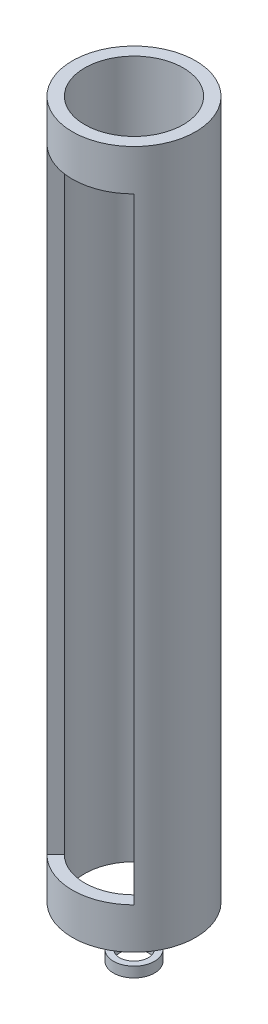
ISO-10303-21;
HEADER;
FILE_DESCRIPTION(('STEP AP214'),'2;1');
FILE_NAME('part.step','',(''),(''),'','','');
FILE_SCHEMA(('AUTOMOTIVE_DESIGN { 1 0 10303 214 1 1 1 1 }'));
ENDSEC;
DATA;
#1=APPLICATION_CONTEXT('core data for automotive mechanical design processes');
#2=APPLICATION_PROTOCOL_DEFINITION('international standard','automotive_design',2000,#1);
#3=PRODUCT_CONTEXT('',#1,'mechanical');
#4=PRODUCT('Part','Part','',(#3));
#5=PRODUCT_RELATED_PRODUCT_CATEGORY('part','',(#4));
#6=PRODUCT_DEFINITION_FORMATION('','',#4);
#7=PRODUCT_DEFINITION_CONTEXT('part definition',#1,'design');
#8=PRODUCT_DEFINITION('design','',#6,#7);
#9=PRODUCT_DEFINITION_SHAPE('','',#8);
#10=(LENGTH_UNIT() NAMED_UNIT(*) SI_UNIT(.MILLI.,.METRE.));
#11=(NAMED_UNIT(*) PLANE_ANGLE_UNIT() SI_UNIT($,.RADIAN.));
#12=(NAMED_UNIT(*) SI_UNIT($,.STERADIAN.) SOLID_ANGLE_UNIT());
#13=UNCERTAINTY_MEASURE_WITH_UNIT(LENGTH_MEASURE(1.E-05),#10,'distance_accuracy_value','');
#14=(GEOMETRIC_REPRESENTATION_CONTEXT(3) GLOBAL_UNCERTAINTY_ASSIGNED_CONTEXT((#13)) GLOBAL_UNIT_ASSIGNED_CONTEXT((#10,
#11,#12)) REPRESENTATION_CONTEXT('',''));
#15=CARTESIAN_POINT('',(0.,0.,0.));
#16=DIRECTION('',(0.,0.,1.));
#17=DIRECTION('',(1.,0.,0.));
#18=AXIS2_PLACEMENT_3D('',#15,#16,#17);
#19=CARTESIAN_POINT('',(0.,-22.5,0.));
#20=DIRECTION('',(0.,1.,0.));
#21=DIRECTION('',(0.,0.,1.));
#22=AXIS2_PLACEMENT_3D('',#19,#20,#21);
#23=CYLINDRICAL_SURFACE('',#22,3.5);
#24=CARTESIAN_POINT('',(0.,-22.5,0.));
#25=DIRECTION('',(0.,1.,0.));
#26=DIRECTION('',(0.,0.,1.));
#27=AXIS2_PLACEMENT_3D('',#24,#25,#26);
#28=CIRCLE('',#27,3.5);
#29=CARTESIAN_POINT('',(0.,-22.5,3.5));
#30=VERTEX_POINT('',#29);
#31=EDGE_CURVE('E66',#30,#30,#28,.T.);
#32=ORIENTED_EDGE('',*,*,#31,.F.);
#33=EDGE_LOOP('',(#32));
#34=FACE_BOUND('',#33,.T.);
#35=CARTESIAN_POINT('',(0.,-20.,0.));
#36=DIRECTION('',(0.,1.,0.));
#37=DIRECTION('',(0.,0.,1.));
#38=AXIS2_PLACEMENT_3D('',#35,#36,#37);
#39=CIRCLE('',#38,3.5);
#40=CARTESIAN_POINT('',(0.,-20.,3.5));
#41=VERTEX_POINT('',#40);
#42=EDGE_CURVE('E72',#41,#41,#39,.T.);
#43=ORIENTED_EDGE('',*,*,#42,.T.);
#44=EDGE_LOOP('',(#43));
#45=FACE_BOUND('',#44,.T.);
#46=ADVANCED_FACE('F59',(#34,#45),#23,.F.);
#47=CARTESIAN_POINT('',(0.,-22.5,0.));
#48=DIRECTION('',(0.,1.,0.));
#49=DIRECTION('',(0.,0.,1.));
#50=AXIS2_PLACEMENT_3D('',#47,#48,#49);
#51=CYLINDRICAL_SURFACE('',#50,5.);
#52=CARTESIAN_POINT('',(0.,-22.5,0.));
#53=DIRECTION('',(0.,1.,0.));
#54=DIRECTION('',(0.,0.,1.));
#55=AXIS2_PLACEMENT_3D('',#52,#53,#54);
#56=CIRCLE('',#55,5.);
#57=CARTESIAN_POINT('',(0.,-22.5,5.));
#58=VERTEX_POINT('',#57);
#59=EDGE_CURVE('E12',#58,#58,#56,.T.);
#60=ORIENTED_EDGE('',*,*,#59,.T.);
#61=EDGE_LOOP('',(#60));
#62=FACE_BOUND('',#61,.T.);
#63=CARTESIAN_POINT('',(0.,-20.,0.));
#64=DIRECTION('',(0.,1.,0.));
#65=DIRECTION('',(0.,0.,1.));
#66=AXIS2_PLACEMENT_3D('',#63,#64,#65);
#67=CIRCLE('',#66,5.);
#68=CARTESIAN_POINT('',(0.,-20.,5.));
#69=VERTEX_POINT('',#68);
#70=EDGE_CURVE('E62',#69,#69,#67,.T.);
#71=ORIENTED_EDGE('',*,*,#70,.F.);
#72=EDGE_LOOP('',(#71));
#73=FACE_BOUND('',#72,.T.);
#74=ADVANCED_FACE('F81',(#62,#73),#51,.T.);
#75=CARTESIAN_POINT('',(0.,-22.5,0.));
#76=DIRECTION('',(0.,1.,0.));
#77=DIRECTION('',(0.,0.,1.));
#78=AXIS2_PLACEMENT_3D('',#75,#76,#77);
#79=PLANE('',#78);
#80=ORIENTED_EDGE('',*,*,#31,.T.);
#81=EDGE_LOOP('',(#80));
#82=FACE_BOUND('',#81,.T.);
#83=ORIENTED_EDGE('',*,*,#59,.F.);
#84=EDGE_LOOP('',(#83));
#85=FACE_BOUND('',#84,.T.);
#86=ADVANCED_FACE('F83',(#82,#85),#79,.F.);
#87=CARTESIAN_POINT('',(0.,-20.,0.));
#88=DIRECTION('',(0.,1.,0.));
#89=DIRECTION('',(0.,0.,1.));
#90=AXIS2_PLACEMENT_3D('',#87,#88,#89);
#91=PLANE('',#90);
#92=ORIENTED_EDGE('',*,*,#42,.F.);
#93=EDGE_LOOP('',(#92));
#94=FACE_BOUND('',#93,.T.);
#95=ORIENTED_EDGE('',*,*,#70,.T.);
#96=EDGE_LOOP('',(#95));
#97=FACE_BOUND('',#96,.T.);
#98=ADVANCED_FACE('F79',(#94,#97),#91,.T.);
#99=CLOSED_SHELL('',(#46,#74,#86,#98));
#100=MANIFOLD_SOLID_BREP('B2',#99);
#101=CARTESIAN_POINT('',(0.,150.,0.));
#102=DIRECTION('',(0.,-1.,0.));
#103=DIRECTION('',(0.,0.,-1.));
#104=AXIS2_PLACEMENT_3D('',#101,#102,#103);
#105=CYLINDRICAL_SURFACE('',#104,12.);
#106=DIRECTION('',(0.,-1.,0.));
#107=VECTOR('',#106,1.);
#108=CARTESIAN_POINT('',(-8.4852813742385,150.,8.48528137423864));
#109=LINE('',#108,#107);
#110=CARTESIAN_POINT('',(-8.4852813742385,150.,8.48528137423865));
#111=VERTEX_POINT('',#110);
#112=CARTESIAN_POINT('',(-8.4852813742385,0.,8.48528137423865));
#113=VERTEX_POINT('',#112);
#114=EDGE_CURVE('E179',#111,#113,#109,.T.);
#115=ORIENTED_EDGE('',*,*,#114,.T.);
#116=CARTESIAN_POINT('',(0.,0.,0.));
#117=DIRECTION('',(0.,1.,0.));
#118=DIRECTION('',(0.,0.,1.));
#119=AXIS2_PLACEMENT_3D('',#116,#117,#118);
#120=CIRCLE('',#119,12.);
#121=CARTESIAN_POINT('',(8.48528137423865,0.,8.4852813742385));
#122=VERTEX_POINT('',#121);
#123=EDGE_CURVE('E188',#113,#122,#120,.T.);
#124=ORIENTED_EDGE('',*,*,#123,.T.);
#125=DIRECTION('',(0.,-1.,0.));
#126=VECTOR('',#125,1.);
#127=CARTESIAN_POINT('',(8.48528137423865,150.,8.4852813742385));
#128=LINE('',#127,#126);
#129=CARTESIAN_POINT('',(8.48528137423865,150.,8.4852813742385));
#130=VERTEX_POINT('',#129);
#131=EDGE_CURVE('E57',#130,#122,#128,.T.);
#132=ORIENTED_EDGE('',*,*,#131,.F.);
#133=CARTESIAN_POINT('',(0.,150.,0.));
#134=DIRECTION('',(0.,1.,0.));
#135=DIRECTION('',(0.,0.,1.));
#136=AXIS2_PLACEMENT_3D('',#133,#134,#135);
#137=CIRCLE('',#136,12.);
#138=EDGE_CURVE('E158',#111,#130,#137,.T.);
#139=ORIENTED_EDGE('',*,*,#138,.F.);
#140=EDGE_LOOP('',(#115,#124,#132,#139));
#141=FACE_BOUND('',#140,.T.);
#142=CARTESIAN_POINT('',(0.,-10.,0.));
#143=DIRECTION('',(0.,1.,0.));
#144=DIRECTION('',(0.,0.,1.));
#145=AXIS2_PLACEMENT_3D('',#142,#143,#144);
#146=CIRCLE('',#145,12.);
#147=CARTESIAN_POINT('',(0.,-10.,12.));
#148=VERTEX_POINT('',#147);
#149=EDGE_CURVE('E186',#148,#148,#146,.T.);
#150=ORIENTED_EDGE('',*,*,#149,.F.);
#151=EDGE_LOOP('',(#150));
#152=FACE_BOUND('',#151,.T.);
#153=CARTESIAN_POINT('',(0.,160.,0.));
#154=DIRECTION('',(0.,1.,0.));
#155=DIRECTION('',(0.,0.,1.));
#156=AXIS2_PLACEMENT_3D('',#153,#154,#155);
#157=CIRCLE('',#156,12.);
#158=CARTESIAN_POINT('',(0.,160.,12.));
#159=VERTEX_POINT('',#158);
#160=EDGE_CURVE('E174',#159,#159,#157,.T.);
#161=ORIENTED_EDGE('',*,*,#160,.T.);
#162=EDGE_LOOP('',(#161));
#163=FACE_BOUND('',#162,.T.);
#164=ADVANCED_FACE('F121',(#141,#152,#163),#105,.F.);
#165=CARTESIAN_POINT('',(0.,150.,0.));
#166=DIRECTION('',(0.707106781186542,0.,-0.707106781186553));
#167=DIRECTION('',(-0.707106781186553,0.,-0.707106781186542));
#168=AXIS2_PLACEMENT_3D('',#165,#166,#167);
#169=PLANE('',#168);
#170=DIRECTION('',(0.707106781186553,0.,0.707106781186542));
#171=VECTOR('',#170,1.);
#172=CARTESIAN_POINT('',(0.,0.,0.));
#173=LINE('',#172,#171);
#174=CARTESIAN_POINT('',(10.6066017177983,0.,10.6066017177981));
#175=VERTEX_POINT('',#174);
#176=EDGE_CURVE('E178',#122,#175,#173,.T.);
#177=ORIENTED_EDGE('',*,*,#176,.T.);
#178=DIRECTION('',(0.,-1.,0.));
#179=VECTOR('',#178,1.);
#180=CARTESIAN_POINT('',(10.6066017177983,150.,10.6066017177981));
#181=LINE('',#180,#179);
#182=CARTESIAN_POINT('',(10.6066017177983,150.,10.6066017177981));
#183=VERTEX_POINT('',#182);
#184=EDGE_CURVE('E129',#183,#175,#181,.T.);
#185=ORIENTED_EDGE('',*,*,#184,.F.);
#186=DIRECTION('',(0.707106781186553,0.,0.707106781186542));
#187=VECTOR('',#186,1.);
#188=CARTESIAN_POINT('',(0.,150.,0.));
#189=LINE('',#188,#187);
#190=EDGE_CURVE('E155',#130,#183,#189,.T.);
#191=ORIENTED_EDGE('',*,*,#190,.F.);
#192=ORIENTED_EDGE('',*,*,#131,.T.);
#193=EDGE_LOOP('',(#177,#185,#191,#192));
#194=FACE_BOUND('',#193,.T.);
#195=ADVANCED_FACE('F177',(#194),#169,.F.);
#196=CARTESIAN_POINT('',(0.,150.,0.));
#197=DIRECTION('',(0.,-1.,0.));
#198=DIRECTION('',(0.,0.,-1.));
#199=AXIS2_PLACEMENT_3D('',#196,#197,#198);
#200=CYLINDRICAL_SURFACE('',#199,15.);
#201=ORIENTED_EDGE('',*,*,#184,.T.);
#202=CARTESIAN_POINT('',(0.,0.,0.));
#203=DIRECTION('',(0.,1.,0.));
#204=DIRECTION('',(0.,0.,1.));
#205=AXIS2_PLACEMENT_3D('',#202,#203,#204);
#206=CIRCLE('',#205,15.);
#207=CARTESIAN_POINT('',(-10.6066017177981,0.,10.6066017177983));
#208=VERTEX_POINT('',#207);
#209=EDGE_CURVE('E192',#208,#175,#206,.T.);
#210=ORIENTED_EDGE('',*,*,#209,.F.);
#211=DIRECTION('',(0.,-1.,0.));
#212=VECTOR('',#211,1.);
#213=CARTESIAN_POINT('',(-10.6066017177981,150.,10.6066017177983));
#214=LINE('',#213,#212);
#215=CARTESIAN_POINT('',(-10.6066017177981,150.,10.6066017177983));
#216=VERTEX_POINT('',#215);
#217=EDGE_CURVE('E171',#216,#208,#214,.T.);
#218=ORIENTED_EDGE('',*,*,#217,.F.);
#219=CARTESIAN_POINT('',(0.,150.,0.));
#220=DIRECTION('',(0.,1.,0.));
#221=DIRECTION('',(0.,0.,1.));
#222=AXIS2_PLACEMENT_3D('',#219,#220,#221);
#223=CIRCLE('',#222,15.);
#224=EDGE_CURVE('E135',#216,#183,#223,.T.);
#225=ORIENTED_EDGE('',*,*,#224,.T.);
#226=EDGE_LOOP('',(#201,#210,#218,#225));
#227=FACE_BOUND('',#226,.T.);
#228=CARTESIAN_POINT('',(0.,-10.,0.));
#229=DIRECTION('',(0.,1.,0.));
#230=DIRECTION('',(0.,0.,1.));
#231=AXIS2_PLACEMENT_3D('',#228,#229,#230);
#232=CIRCLE('',#231,15.);
#233=CARTESIAN_POINT('',(0.,-10.,15.));
#234=VERTEX_POINT('',#233);
#235=EDGE_CURVE('E191',#234,#234,#232,.T.);
#236=ORIENTED_EDGE('',*,*,#235,.T.);
#237=EDGE_LOOP('',(#236));
#238=FACE_BOUND('',#237,.T.);
#239=CARTESIAN_POINT('',(0.,160.,0.));
#240=DIRECTION('',(0.,1.,0.));
#241=DIRECTION('',(0.,0.,1.));
#242=AXIS2_PLACEMENT_3D('',#239,#240,#241);
#243=CIRCLE('',#242,15.);
#244=CARTESIAN_POINT('',(0.,160.,15.));
#245=VERTEX_POINT('',#244);
#246=EDGE_CURVE('E173',#245,#245,#243,.T.);
#247=ORIENTED_EDGE('',*,*,#246,.F.);
#248=EDGE_LOOP('',(#247));
#249=FACE_BOUND('',#248,.T.);
#250=ADVANCED_FACE('F167',(#227,#238,#249),#200,.T.);
#251=CARTESIAN_POINT('',(0.,150.,0.));
#252=DIRECTION('',(0.707106781186554,0.,0.707106781186541));
#253=DIRECTION('',(0.707106781186541,0.,-0.707106781186554));
#254=AXIS2_PLACEMENT_3D('',#251,#252,#253);
#255=PLANE('',#254);
#256=DIRECTION('',(-0.707106781186541,0.,0.707106781186554));
#257=VECTOR('',#256,1.);
#258=CARTESIAN_POINT('',(0.,0.,0.));
#259=LINE('',#258,#257);
#260=EDGE_CURVE('E163',#113,#208,#259,.T.);
#261=ORIENTED_EDGE('',*,*,#260,.F.);
#262=ORIENTED_EDGE('',*,*,#114,.F.);
#263=DIRECTION('',(-0.707106781186541,0.,0.707106781186554));
#264=VECTOR('',#263,1.);
#265=CARTESIAN_POINT('',(0.,150.,0.));
#266=LINE('',#265,#264);
#267=EDGE_CURVE('E162',#111,#216,#266,.T.);
#268=ORIENTED_EDGE('',*,*,#267,.T.);
#269=ORIENTED_EDGE('',*,*,#217,.T.);
#270=EDGE_LOOP('',(#261,#262,#268,#269));
#271=FACE_BOUND('',#270,.T.);
#272=ADVANCED_FACE('F227',(#271),#255,.T.);
#273=CARTESIAN_POINT('',(0.,-10.,0.));
#274=DIRECTION('',(0.,1.,0.));
#275=DIRECTION('',(0.,0.,1.));
#276=AXIS2_PLACEMENT_3D('',#273,#274,#275);
#277=PLANE('',#276);
#278=ORIENTED_EDGE('',*,*,#235,.F.);
#279=EDGE_LOOP('',(#278));
#280=FACE_BOUND('',#279,.T.);
#281=ORIENTED_EDGE('',*,*,#149,.T.);
#282=EDGE_LOOP('',(#281));
#283=FACE_BOUND('',#282,.T.);
#284=ADVANCED_FACE('F225',(#280,#283),#277,.F.);
#285=CARTESIAN_POINT('',(0.,0.,0.));
#286=DIRECTION('',(0.,1.,0.));
#287=DIRECTION('',(0.,0.,1.));
#288=AXIS2_PLACEMENT_3D('',#285,#286,#287);
#289=PLANE('',#288);
#290=ORIENTED_EDGE('',*,*,#123,.F.);
#291=ORIENTED_EDGE('',*,*,#260,.T.);
#292=ORIENTED_EDGE('',*,*,#209,.T.);
#293=ORIENTED_EDGE('',*,*,#176,.F.);
#294=EDGE_LOOP('',(#290,#291,#292,#293));
#295=FACE_BOUND('',#294,.T.);
#296=ADVANCED_FACE('F212',(#295),#289,.T.);
#297=CARTESIAN_POINT('',(0.,150.,0.));
#298=DIRECTION('',(0.,1.,0.));
#299=DIRECTION('',(0.,0.,1.));
#300=AXIS2_PLACEMENT_3D('',#297,#298,#299);
#301=PLANE('',#300);
#302=ORIENTED_EDGE('',*,*,#138,.T.);
#303=ORIENTED_EDGE('',*,*,#190,.T.);
#304=ORIENTED_EDGE('',*,*,#224,.F.);
#305=ORIENTED_EDGE('',*,*,#267,.F.);
#306=EDGE_LOOP('',(#302,#303,#304,#305));
#307=FACE_BOUND('',#306,.T.);
#308=ADVANCED_FACE('F156',(#307),#301,.F.);
#309=CARTESIAN_POINT('',(0.,160.,0.));
#310=DIRECTION('',(0.,1.,0.));
#311=DIRECTION('',(0.,0.,1.));
#312=AXIS2_PLACEMENT_3D('',#309,#310,#311);
#313=PLANE('',#312);
#314=ORIENTED_EDGE('',*,*,#246,.T.);
#315=EDGE_LOOP('',(#314));
#316=FACE_BOUND('',#315,.T.);
#317=ORIENTED_EDGE('',*,*,#160,.F.);
#318=EDGE_LOOP('',(#317));
#319=FACE_BOUND('',#318,.T.);
#320=ADVANCED_FACE('F205',(#316,#319),#313,.T.);
#321=CLOSED_SHELL('',(#164,#195,#250,#272,#284,#296,#308,#320));
#322=MANIFOLD_SOLID_BREP('B7',#321);
#323=ADVANCED_BREP_SHAPE_REPRESENTATION('',(#18,#100,#322),#14);
#324=SHAPE_DEFINITION_REPRESENTATION(#9,#323);
ENDSEC;
END-ISO-10303-21;
